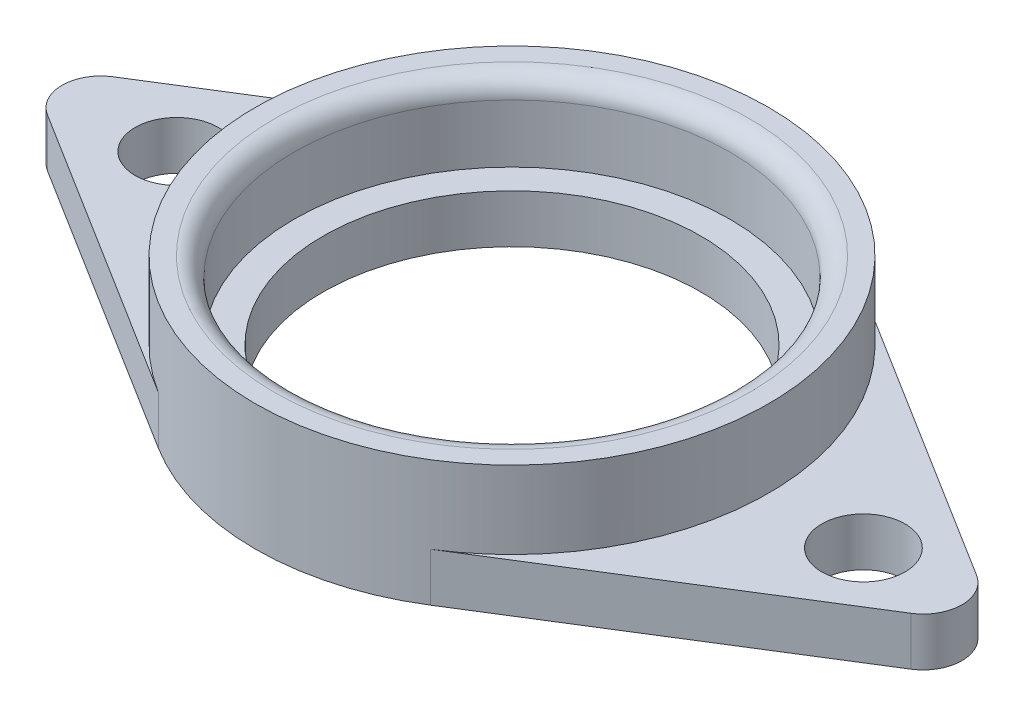
ISO-10303-21;
HEADER;
FILE_DESCRIPTION(('STEP AP214'),'2;1');
FILE_NAME('part.step','',(''),(''),'','','');
FILE_SCHEMA(('AUTOMOTIVE_DESIGN { 1 0 10303 214 1 1 1 1 }'));
ENDSEC;
DATA;
#1=APPLICATION_CONTEXT('core data for automotive mechanical design processes');
#2=APPLICATION_PROTOCOL_DEFINITION('international standard','automotive_design',2000,#1);
#3=PRODUCT_CONTEXT('',#1,'mechanical');
#4=PRODUCT('Part','Part','',(#3));
#5=PRODUCT_RELATED_PRODUCT_CATEGORY('part','',(#4));
#6=PRODUCT_DEFINITION_FORMATION('','',#4);
#7=PRODUCT_DEFINITION_CONTEXT('part definition',#1,'design');
#8=PRODUCT_DEFINITION('design','',#6,#7);
#9=PRODUCT_DEFINITION_SHAPE('','',#8);
#10=(LENGTH_UNIT() NAMED_UNIT(*) SI_UNIT(.MILLI.,.METRE.));
#11=(NAMED_UNIT(*) PLANE_ANGLE_UNIT() SI_UNIT($,.RADIAN.));
#12=(NAMED_UNIT(*) SI_UNIT($,.STERADIAN.) SOLID_ANGLE_UNIT());
#13=UNCERTAINTY_MEASURE_WITH_UNIT(LENGTH_MEASURE(1.E-05),#10,'distance_accuracy_value','');
#14=(GEOMETRIC_REPRESENTATION_CONTEXT(3) GLOBAL_UNCERTAINTY_ASSIGNED_CONTEXT((#13)) GLOBAL_UNIT_ASSIGNED_CONTEXT((#10,
#11,#12)) REPRESENTATION_CONTEXT('',''));
#15=CARTESIAN_POINT('',(0.,0.,0.));
#16=DIRECTION('',(0.,0.,1.));
#17=DIRECTION('',(1.,0.,0.));
#18=AXIS2_PLACEMENT_3D('',#15,#16,#17);
#19=CARTESIAN_POINT('',(0.,2.5,0.));
#20=DIRECTION('',(0.,1.,0.));
#21=DIRECTION('',(0.,0.,1.));
#22=AXIS2_PLACEMENT_3D('',#19,#20,#21);
#23=PLANE('',#22);
#24=CARTESIAN_POINT('',(0.,2.5,0.));
#25=DIRECTION('',(0.,1.,0.));
#26=DIRECTION('',(0.,0.,1.));
#27=AXIS2_PLACEMENT_3D('',#24,#25,#26);
#28=CIRCLE('',#27,13.25);
#29=CARTESIAN_POINT('',(7.02250000000001,2.5,11.2359687499565));
#30=VERTEX_POINT('',#29);
#31=CARTESIAN_POINT('',(7.0225,2.5,-11.2359687499565));
#32=VERTEX_POINT('',#31);
#33=EDGE_CURVE('E186',#30,#32,#28,.T.);
#34=ORIENTED_EDGE('',*,*,#33,.F.);
#35=DIRECTION('',(-0.847997641506154,0.,0.53));
#36=VECTOR('',#35,1.);
#37=CARTESIAN_POINT('',(7.0225,2.5,11.2359687499565));
#38=LINE('',#37,#36);
#39=CARTESIAN_POINT('',(22.2864150943396,2.5,1.6959952830123));
#40=VERTEX_POINT('',#39);
#41=EDGE_CURVE('E271',#40,#30,#38,.T.);
#42=ORIENTED_EDGE('',*,*,#41,.F.);
#43=CARTESIAN_POINT('',(21.2264150943396,2.5,0.));
#44=DIRECTION('',(0.,1.,0.));
#45=DIRECTION('',(0.,0.,1.));
#46=AXIS2_PLACEMENT_3D('',#43,#44,#45);
#47=CIRCLE('',#46,2.);
#48=CARTESIAN_POINT('',(22.2864150943396,2.5,-1.69599528301232));
#49=VERTEX_POINT('',#48);
#50=EDGE_CURVE('E133',#49,#40,#47,.F.);
#51=ORIENTED_EDGE('',*,*,#50,.F.);
#52=DIRECTION('',(0.847997641506154,0.,0.53));
#53=VECTOR('',#52,1.);
#54=CARTESIAN_POINT('',(7.0225,2.5,-11.2359687499565));
#55=LINE('',#54,#53);
#56=EDGE_CURVE('E130',#32,#49,#55,.T.);
#57=ORIENTED_EDGE('',*,*,#56,.F.);
#58=EDGE_LOOP('',(#34,#42,#51,#57));
#59=FACE_BOUND('',#58,.T.);
#60=CARTESIAN_POINT('',(18.1402262835206,2.5,0.));
#61=DIRECTION('',(0.,1.,0.));
#62=DIRECTION('',(0.,0.,1.));
#63=AXIS2_PLACEMENT_3D('',#60,#61,#62);
#64=CIRCLE('',#63,2.15);
#65=CARTESIAN_POINT('',(18.1402262835206,2.5,2.15));
#66=VERTEX_POINT('',#65);
#67=EDGE_CURVE('E172',#66,#66,#64,.T.);
#68=ORIENTED_EDGE('',*,*,#67,.F.);
#69=EDGE_LOOP('',(#68));
#70=FACE_BOUND('',#69,.T.);
#71=ADVANCED_FACE('F35',(#59,#70),#23,.T.);
#72=CARTESIAN_POINT('',(0.,2.5,0.));
#73=DIRECTION('',(0.,1.,0.));
#74=DIRECTION('',(0.,0.,1.));
#75=AXIS2_PLACEMENT_3D('',#72,#73,#74);
#76=CIRCLE('',#75,9.74999999999999);
#77=CARTESIAN_POINT('',(0.,2.5,9.74999999999999));
#78=VERTEX_POINT('',#77);
#79=EDGE_CURVE('E138',#78,#78,#76,.T.);
#80=ORIENTED_EDGE('',*,*,#79,.F.);
#81=EDGE_LOOP('',(#80));
#82=FACE_BOUND('',#81,.T.);
#83=CARTESIAN_POINT('',(0.,2.5,0.));
#84=DIRECTION('',(0.,1.,0.));
#85=DIRECTION('',(0.,0.,1.));
#86=AXIS2_PLACEMENT_3D('',#83,#84,#85);
#87=CIRCLE('',#86,11.25);
#88=CARTESIAN_POINT('',(0.,2.5,11.25));
#89=VERTEX_POINT('',#88);
#90=EDGE_CURVE('E191',#89,#89,#87,.T.);
#91=ORIENTED_EDGE('',*,*,#90,.T.);
#92=EDGE_LOOP('',(#91));
#93=FACE_BOUND('',#92,.T.);
#94=ADVANCED_FACE('F198',(#82,#93),#23,.T.);
#95=CARTESIAN_POINT('',(7.0225,2.5,11.2359687499565));
#96=DIRECTION('',(0.53,0.,0.847997641506154));
#97=DIRECTION('',(0.847997641506154,0.,-0.53));
#98=AXIS2_PLACEMENT_3D('',#95,#96,#97);
#99=PLANE('',#98);
#100=DIRECTION('',(-0.847997641506154,0.,0.53));
#101=VECTOR('',#100,1.);
#102=CARTESIAN_POINT('',(7.0225,0.,11.2359687499565));
#103=LINE('',#102,#101);
#104=CARTESIAN_POINT('',(22.2864150943396,0.,1.6959952830123));
#105=VERTEX_POINT('',#104);
#106=CARTESIAN_POINT('',(7.0225,0.,11.2359687499565));
#107=VERTEX_POINT('',#106);
#108=EDGE_CURVE('E147',#105,#107,#103,.T.);
#109=ORIENTED_EDGE('',*,*,#108,.F.);
#110=DIRECTION('',(0.,-1.,0.));
#111=VECTOR('',#110,1.);
#112=CARTESIAN_POINT('',(22.2864150943396,2.5,1.6959952830123));
#113=LINE('',#112,#111);
#114=EDGE_CURVE('E93',#40,#105,#113,.T.);
#115=ORIENTED_EDGE('',*,*,#114,.F.);
#116=ORIENTED_EDGE('',*,*,#41,.T.);
#117=DIRECTION('',(0.,-1.,0.));
#118=VECTOR('',#117,1.);
#119=CARTESIAN_POINT('',(7.0225,2.5,11.2359687499565));
#120=LINE('',#119,#118);
#121=EDGE_CURVE('E89',#30,#107,#120,.T.);
#122=ORIENTED_EDGE('',*,*,#121,.T.);
#123=EDGE_LOOP('',(#109,#115,#116,#122));
#124=FACE_BOUND('',#123,.T.);
#125=ADVANCED_FACE('F218',(#124),#99,.T.);
#126=CARTESIAN_POINT('',(21.2264150943396,2.5,0.));
#127=DIRECTION('',(0.,-1.,0.));
#128=DIRECTION('',(0.,0.,-1.));
#129=AXIS2_PLACEMENT_3D('',#126,#127,#128);
#130=CYLINDRICAL_SURFACE('',#129,2.);
#131=CARTESIAN_POINT('',(21.2264150943396,0.,0.));
#132=DIRECTION('',(0.,1.,0.));
#133=DIRECTION('',(0.,0.,1.));
#134=AXIS2_PLACEMENT_3D('',#131,#132,#133);
#135=CIRCLE('',#134,2.);
#136=CARTESIAN_POINT('',(22.2864150943396,0.,-1.69599528301232));
#137=VERTEX_POINT('',#136);
#138=EDGE_CURVE('E150',#137,#105,#135,.F.);
#139=ORIENTED_EDGE('',*,*,#138,.F.);
#140=DIRECTION('',(0.,-1.,0.));
#141=VECTOR('',#140,1.);
#142=CARTESIAN_POINT('',(22.2864150943396,2.5,-1.69599528301232));
#143=LINE('',#142,#141);
#144=EDGE_CURVE('E180',#49,#137,#143,.T.);
#145=ORIENTED_EDGE('',*,*,#144,.F.);
#146=ORIENTED_EDGE('',*,*,#50,.T.);
#147=ORIENTED_EDGE('',*,*,#114,.T.);
#148=EDGE_LOOP('',(#139,#145,#146,#147));
#149=FACE_BOUND('',#148,.T.);
#150=ADVANCED_FACE('F256',(#149),#130,.T.);
#151=CARTESIAN_POINT('',(7.0225,2.5,-11.2359687499565));
#152=DIRECTION('',(0.53,0.,-0.847997641506154));
#153=DIRECTION('',(-0.847997641506154,0.,-0.53));
#154=AXIS2_PLACEMENT_3D('',#151,#152,#153);
#155=PLANE('',#154);
#156=DIRECTION('',(0.847997641506154,0.,0.53));
#157=VECTOR('',#156,1.);
#158=CARTESIAN_POINT('',(7.0225,0.,-11.2359687499565));
#159=LINE('',#158,#157);
#160=CARTESIAN_POINT('',(7.0225,0.,-11.2359687499565));
#161=VERTEX_POINT('',#160);
#162=EDGE_CURVE('E153',#161,#137,#159,.T.);
#163=ORIENTED_EDGE('',*,*,#162,.F.);
#164=DIRECTION('',(0.,-1.,0.));
#165=VECTOR('',#164,1.);
#166=CARTESIAN_POINT('',(7.0225,2.5,-11.2359687499565));
#167=LINE('',#166,#165);
#168=EDGE_CURVE('E178',#32,#161,#167,.T.);
#169=ORIENTED_EDGE('',*,*,#168,.F.);
#170=ORIENTED_EDGE('',*,*,#56,.T.);
#171=ORIENTED_EDGE('',*,*,#144,.T.);
#172=EDGE_LOOP('',(#163,#169,#170,#171));
#173=FACE_BOUND('',#172,.T.);
#174=ADVANCED_FACE('F253',(#173),#155,.T.);
#175=CARTESIAN_POINT('',(-7.02250000000001,2.5,-11.2359687499565));
#176=DIRECTION('',(-0.53,0.,-0.847997641506154));
#177=DIRECTION('',(-0.847997641506154,0.,0.53));
#178=AXIS2_PLACEMENT_3D('',#175,#176,#177);
#179=PLANE('',#178);
#180=DIRECTION('',(0.847997641506154,0.,-0.53));
#181=VECTOR('',#180,1.);
#182=CARTESIAN_POINT('',(-7.02250000000001,0.,-11.2359687499565));
#183=LINE('',#182,#181);
#184=CARTESIAN_POINT('',(-22.2864150943396,0.,-1.69599528301231));
#185=VERTEX_POINT('',#184);
#186=CARTESIAN_POINT('',(-7.0225,0.,-11.2359687499565));
#187=VERTEX_POINT('',#186);
#188=EDGE_CURVE('E113',#185,#187,#183,.T.);
#189=ORIENTED_EDGE('',*,*,#188,.F.);
#190=DIRECTION('',(0.,-1.,0.));
#191=VECTOR('',#190,1.);
#192=CARTESIAN_POINT('',(-22.2864150943396,2.5,-1.69599528301231));
#193=LINE('',#192,#191);
#194=CARTESIAN_POINT('',(-22.2864150943396,2.5,-1.69599528301231));
#195=VERTEX_POINT('',#194);
#196=EDGE_CURVE('E107',#195,#185,#193,.T.);
#197=ORIENTED_EDGE('',*,*,#196,.F.);
#198=DIRECTION('',(0.847997641506154,0.,-0.53));
#199=VECTOR('',#198,1.);
#200=CARTESIAN_POINT('',(-7.02250000000001,2.5,-11.2359687499565));
#201=LINE('',#200,#199);
#202=CARTESIAN_POINT('',(-7.0225,2.5,-11.2359687499565));
#203=VERTEX_POINT('',#202);
#204=EDGE_CURVE('E111',#195,#203,#201,.T.);
#205=ORIENTED_EDGE('',*,*,#204,.T.);
#206=DIRECTION('',(0.,-1.,0.));
#207=VECTOR('',#206,1.);
#208=CARTESIAN_POINT('',(-7.0225,2.5,-11.2359687499565));
#209=LINE('',#208,#207);
#210=EDGE_CURVE('E117',#203,#187,#209,.T.);
#211=ORIENTED_EDGE('',*,*,#210,.T.);
#212=EDGE_LOOP('',(#189,#197,#205,#211));
#213=FACE_BOUND('',#212,.T.);
#214=ADVANCED_FACE('F109',(#213),#179,.T.);
#215=CARTESIAN_POINT('',(-21.2264150943396,2.5,0.));
#216=DIRECTION('',(0.,-1.,0.));
#217=DIRECTION('',(0.,0.,-1.));
#218=AXIS2_PLACEMENT_3D('',#215,#216,#217);
#219=CYLINDRICAL_SURFACE('',#218,2.);
#220=CARTESIAN_POINT('',(-21.2264150943396,0.,0.));
#221=DIRECTION('',(0.,1.,0.));
#222=DIRECTION('',(0.,0.,1.));
#223=AXIS2_PLACEMENT_3D('',#220,#221,#222);
#224=CIRCLE('',#223,2.);
#225=CARTESIAN_POINT('',(-22.2864150943396,0.,1.69599528301231));
#226=VERTEX_POINT('',#225);
#227=EDGE_CURVE('E160',#185,#226,#224,.T.);
#228=ORIENTED_EDGE('',*,*,#227,.T.);
#229=DIRECTION('',(0.,-1.,0.));
#230=VECTOR('',#229,1.);
#231=CARTESIAN_POINT('',(-22.2864150943396,2.5,1.69599528301231));
#232=LINE('',#231,#230);
#233=CARTESIAN_POINT('',(-22.2864150943396,2.5,1.69599528301231));
#234=VERTEX_POINT('',#233);
#235=EDGE_CURVE('E118',#234,#226,#232,.T.);
#236=ORIENTED_EDGE('',*,*,#235,.F.);
#237=CARTESIAN_POINT('',(-21.2264150943396,2.5,0.));
#238=DIRECTION('',(0.,1.,0.));
#239=DIRECTION('',(0.,0.,1.));
#240=AXIS2_PLACEMENT_3D('',#237,#238,#239);
#241=CIRCLE('',#240,2.);
#242=EDGE_CURVE('E121',#195,#234,#241,.T.);
#243=ORIENTED_EDGE('',*,*,#242,.F.);
#244=ORIENTED_EDGE('',*,*,#196,.T.);
#245=EDGE_LOOP('',(#228,#236,#243,#244));
#246=FACE_BOUND('',#245,.T.);
#247=ADVANCED_FACE('F122',(#246),#219,.T.);
#248=CARTESIAN_POINT('',(-7.0225,2.5,11.2359687499565));
#249=DIRECTION('',(0.53,0.,-0.847997641506154));
#250=DIRECTION('',(-0.847997641506154,0.,-0.53));
#251=AXIS2_PLACEMENT_3D('',#248,#249,#250);
#252=PLANE('',#251);
#253=DIRECTION('',(0.847997641506154,0.,0.53));
#254=VECTOR('',#253,1.);
#255=CARTESIAN_POINT('',(-7.0225,0.,11.2359687499565));
#256=LINE('',#255,#254);
#257=CARTESIAN_POINT('',(-7.0225,0.,11.2359687499565));
#258=VERTEX_POINT('',#257);
#259=EDGE_CURVE('E162',#226,#258,#256,.T.);
#260=ORIENTED_EDGE('',*,*,#259,.T.);
#261=DIRECTION('',(0.,-1.,0.));
#262=VECTOR('',#261,1.);
#263=CARTESIAN_POINT('',(-7.0225,2.5,11.2359687499565));
#264=LINE('',#263,#262);
#265=CARTESIAN_POINT('',(-7.0225,2.5,11.2359687499565));
#266=VERTEX_POINT('',#265);
#267=EDGE_CURVE('E174',#266,#258,#264,.T.);
#268=ORIENTED_EDGE('',*,*,#267,.F.);
#269=DIRECTION('',(0.847997641506154,0.,0.53));
#270=VECTOR('',#269,1.);
#271=CARTESIAN_POINT('',(-7.0225,2.5,11.2359687499565));
#272=LINE('',#271,#270);
#273=EDGE_CURVE('E52',#234,#266,#272,.T.);
#274=ORIENTED_EDGE('',*,*,#273,.F.);
#275=ORIENTED_EDGE('',*,*,#235,.T.);
#276=EDGE_LOOP('',(#260,#268,#274,#275));
#277=FACE_BOUND('',#276,.T.);
#278=ADVANCED_FACE('F242',(#277),#252,.F.);
#279=CARTESIAN_POINT('',(0.,2.5,0.));
#280=DIRECTION('',(0.,-1.,0.));
#281=DIRECTION('',(0.,0.,-1.));
#282=AXIS2_PLACEMENT_3D('',#279,#280,#281);
#283=CYLINDRICAL_SURFACE('',#282,9.74999999999999);
#284=ORIENTED_EDGE('',*,*,#79,.T.);
#285=EDGE_LOOP('',(#284));
#286=FACE_BOUND('',#285,.T.);
#287=CARTESIAN_POINT('',(0.,0.,0.));
#288=DIRECTION('',(0.,1.,0.));
#289=DIRECTION('',(0.,0.,1.));
#290=AXIS2_PLACEMENT_3D('',#287,#288,#289);
#291=CIRCLE('',#290,9.74999999999999);
#292=CARTESIAN_POINT('',(0.,0.,9.74999999999999));
#293=VERTEX_POINT('',#292);
#294=EDGE_CURVE('E166',#293,#293,#291,.T.);
#295=ORIENTED_EDGE('',*,*,#294,.F.);
#296=EDGE_LOOP('',(#295));
#297=FACE_BOUND('',#296,.T.);
#298=ADVANCED_FACE('F239',(#286,#297),#283,.F.);
#299=CARTESIAN_POINT('',(0.,2.5,0.));
#300=DIRECTION('',(0.,-1.,0.));
#301=DIRECTION('',(0.,0.,-1.));
#302=AXIS2_PLACEMENT_3D('',#299,#300,#301);
#303=CYLINDRICAL_SURFACE('',#302,13.25);
#304=CARTESIAN_POINT('',(0.,0.,0.));
#305=DIRECTION('',(0.,1.,0.));
#306=DIRECTION('',(0.,0.,1.));
#307=AXIS2_PLACEMENT_3D('',#304,#305,#306);
#308=CIRCLE('',#307,13.25);
#309=EDGE_CURVE('E81',#258,#107,#308,.T.);
#310=ORIENTED_EDGE('',*,*,#309,.T.);
#311=ORIENTED_EDGE('',*,*,#121,.F.);
#312=ORIENTED_EDGE('',*,*,#33,.T.);
#313=ORIENTED_EDGE('',*,*,#168,.T.);
#314=CARTESIAN_POINT('',(0.,0.,0.));
#315=DIRECTION('',(0.,1.,0.));
#316=DIRECTION('',(0.,0.,1.));
#317=AXIS2_PLACEMENT_3D('',#314,#315,#316);
#318=CIRCLE('',#317,13.25);
#319=EDGE_CURVE('E156',#161,#187,#318,.T.);
#320=ORIENTED_EDGE('',*,*,#319,.T.);
#321=ORIENTED_EDGE('',*,*,#210,.F.);
#322=EDGE_CURVE('E128',#203,#266,#28,.T.);
#323=ORIENTED_EDGE('',*,*,#322,.T.);
#324=ORIENTED_EDGE('',*,*,#267,.T.);
#325=EDGE_LOOP('',(#310,#311,#312,#313,#320,#321,#323,#324));
#326=FACE_BOUND('',#325,.T.);
#327=CARTESIAN_POINT('',(0.,6.5,0.));
#328=DIRECTION('',(0.,1.,0.));
#329=DIRECTION('',(0.,0.,1.));
#330=AXIS2_PLACEMENT_3D('',#327,#328,#329);
#331=CIRCLE('',#330,13.25);
#332=CARTESIAN_POINT('',(0.,6.5,13.25));
#333=VERTEX_POINT('',#332);
#334=EDGE_CURVE('E148',#333,#333,#331,.T.);
#335=ORIENTED_EDGE('',*,*,#334,.F.);
#336=EDGE_LOOP('',(#335));
#337=FACE_BOUND('',#336,.T.);
#338=ADVANCED_FACE('F235',(#326,#337),#303,.T.);
#339=CARTESIAN_POINT('',(18.1402262835206,2.5,0.));
#340=DIRECTION('',(0.,-1.,0.));
#341=DIRECTION('',(0.,0.,-1.));
#342=AXIS2_PLACEMENT_3D('',#339,#340,#341);
#343=CYLINDRICAL_SURFACE('',#342,2.15);
#344=ORIENTED_EDGE('',*,*,#67,.T.);
#345=EDGE_LOOP('',(#344));
#346=FACE_BOUND('',#345,.T.);
#347=CARTESIAN_POINT('',(18.1402262835206,0.,0.));
#348=DIRECTION('',(0.,1.,0.));
#349=DIRECTION('',(0.,0.,1.));
#350=AXIS2_PLACEMENT_3D('',#347,#348,#349);
#351=CIRCLE('',#350,2.15);
#352=CARTESIAN_POINT('',(18.1402262835206,0.,2.15));
#353=VERTEX_POINT('',#352);
#354=EDGE_CURVE('E144',#353,#353,#351,.T.);
#355=ORIENTED_EDGE('',*,*,#354,.F.);
#356=EDGE_LOOP('',(#355));
#357=FACE_BOUND('',#356,.T.);
#358=ADVANCED_FACE('F229',(#346,#357),#343,.F.);
#359=CARTESIAN_POINT('',(-17.3051980294616,2.5,0.));
#360=DIRECTION('',(0.,-1.,0.));
#361=DIRECTION('',(0.,0.,-1.));
#362=AXIS2_PLACEMENT_3D('',#359,#360,#361);
#363=CYLINDRICAL_SURFACE('',#362,2.15);
#364=CARTESIAN_POINT('',(-17.3051980294616,2.5,0.));
#365=DIRECTION('',(0.,1.,0.));
#366=DIRECTION('',(0.,0.,1.));
#367=AXIS2_PLACEMENT_3D('',#364,#365,#366);
#368=CIRCLE('',#367,2.15);
#369=CARTESIAN_POINT('',(-17.3051980294616,2.5,2.15));
#370=VERTEX_POINT('',#369);
#371=EDGE_CURVE('E141',#370,#370,#368,.T.);
#372=ORIENTED_EDGE('',*,*,#371,.T.);
#373=EDGE_LOOP('',(#372));
#374=FACE_BOUND('',#373,.T.);
#375=CARTESIAN_POINT('',(-17.3051980294616,0.,0.));
#376=DIRECTION('',(0.,1.,0.));
#377=DIRECTION('',(0.,0.,1.));
#378=AXIS2_PLACEMENT_3D('',#375,#376,#377);
#379=CIRCLE('',#378,2.15);
#380=CARTESIAN_POINT('',(-17.3051980294616,0.,2.15));
#381=VERTEX_POINT('',#380);
#382=EDGE_CURVE('E169',#381,#381,#379,.T.);
#383=ORIENTED_EDGE('',*,*,#382,.F.);
#384=EDGE_LOOP('',(#383));
#385=FACE_BOUND('',#384,.T.);
#386=ADVANCED_FACE('F223',(#374,#385),#363,.F.);
#387=ORIENTED_EDGE('',*,*,#322,.F.);
#388=ORIENTED_EDGE('',*,*,#204,.F.);
#389=ORIENTED_EDGE('',*,*,#242,.T.);
#390=ORIENTED_EDGE('',*,*,#273,.T.);
#391=EDGE_LOOP('',(#387,#388,#389,#390));
#392=FACE_BOUND('',#391,.T.);
#393=ORIENTED_EDGE('',*,*,#371,.F.);
#394=EDGE_LOOP('',(#393));
#395=FACE_BOUND('',#394,.T.);
#396=ADVANCED_FACE('F125',(#392,#395),#23,.T.);
#397=CARTESIAN_POINT('',(0.,0.,0.));
#398=DIRECTION('',(0.,1.,0.));
#399=DIRECTION('',(0.,0.,1.));
#400=AXIS2_PLACEMENT_3D('',#397,#398,#399);
#401=PLANE('',#400);
#402=ORIENTED_EDGE('',*,*,#354,.T.);
#403=EDGE_LOOP('',(#402));
#404=FACE_BOUND('',#403,.T.);
#405=ORIENTED_EDGE('',*,*,#108,.T.);
#406=ORIENTED_EDGE('',*,*,#309,.F.);
#407=ORIENTED_EDGE('',*,*,#259,.F.);
#408=ORIENTED_EDGE('',*,*,#227,.F.);
#409=ORIENTED_EDGE('',*,*,#188,.T.);
#410=ORIENTED_EDGE('',*,*,#319,.F.);
#411=ORIENTED_EDGE('',*,*,#162,.T.);
#412=ORIENTED_EDGE('',*,*,#138,.T.);
#413=EDGE_LOOP('',(#405,#406,#407,#408,#409,#410,#411,#412));
#414=FACE_BOUND('',#413,.T.);
#415=ORIENTED_EDGE('',*,*,#294,.T.);
#416=EDGE_LOOP('',(#415));
#417=FACE_BOUND('',#416,.T.);
#418=ORIENTED_EDGE('',*,*,#382,.T.);
#419=EDGE_LOOP('',(#418));
#420=FACE_BOUND('',#419,.T.);
#421=ADVANCED_FACE('F209',(#404,#414,#417,#420),#401,.F.);
#422=CARTESIAN_POINT('',(0.,6.5,0.));
#423=DIRECTION('',(0.,1.,0.));
#424=DIRECTION('',(0.,0.,1.));
#425=AXIS2_PLACEMENT_3D('',#422,#423,#424);
#426=PLANE('',#425);
#427=CARTESIAN_POINT('',(0.,6.5,0.));
#428=DIRECTION('',(0.,1.,0.));
#429=DIRECTION('',(0.,0.,1.));
#430=AXIS2_PLACEMENT_3D('',#427,#428,#429);
#431=CIRCLE('',#430,12.25);
#432=CARTESIAN_POINT('',(0.,6.5,12.25));
#433=VERTEX_POINT('',#432);
#434=EDGE_CURVE('E11',#433,#433,#431,.F.);
#435=ORIENTED_EDGE('',*,*,#434,.T.);
#436=EDGE_LOOP('',(#435));
#437=FACE_BOUND('',#436,.T.);
#438=ORIENTED_EDGE('',*,*,#334,.T.);
#439=EDGE_LOOP('',(#438));
#440=FACE_BOUND('',#439,.T.);
#441=ADVANCED_FACE('F202',(#437,#440),#426,.T.);
#442=CARTESIAN_POINT('',(0.,6.5,0.));
#443=DIRECTION('',(0.,-1.,0.));
#444=DIRECTION('',(0.,0.,-1.));
#445=AXIS2_PLACEMENT_3D('',#442,#443,#444);
#446=CYLINDRICAL_SURFACE('',#445,11.25);
#447=CARTESIAN_POINT('',(0.,5.5,0.));
#448=DIRECTION('',(0.,1.,0.));
#449=DIRECTION('',(0.,0.,1.));
#450=AXIS2_PLACEMENT_3D('',#447,#448,#449);
#451=CIRCLE('',#450,11.25);
#452=CARTESIAN_POINT('',(0.,5.5,11.25));
#453=VERTEX_POINT('',#452);
#454=EDGE_CURVE('E44',#453,#453,#451,.T.);
#455=ORIENTED_EDGE('',*,*,#454,.T.);
#456=EDGE_LOOP('',(#455));
#457=FACE_BOUND('',#456,.T.);
#458=ORIENTED_EDGE('',*,*,#90,.F.);
#459=EDGE_LOOP('',(#458));
#460=FACE_BOUND('',#459,.T.);
#461=ADVANCED_FACE('F200',(#457,#460),#446,.F.);
#462=CARTESIAN_POINT('',(0.,5.5,0.));
#463=DIRECTION('',(0.,1.,0.));
#464=DIRECTION('',(0.,0.,1.));
#465=AXIS2_PLACEMENT_3D('',#462,#463,#464);
#466=TOROIDAL_SURFACE('',#465,12.25,1.);
#467=ORIENTED_EDGE('',*,*,#434,.F.);
#468=EDGE_LOOP('',(#467));
#469=FACE_BOUND('',#468,.T.);
#470=ORIENTED_EDGE('',*,*,#454,.F.);
#471=EDGE_LOOP('',(#470));
#472=FACE_BOUND('',#471,.T.);
#473=ADVANCED_FACE('F37',(#469,#472),#466,.T.);
#474=CLOSED_SHELL('',(#71,#94,#125,#150,#174,#214,#247,#278,#298,#338,#358,#386,#396,#421,#441,
#461,#473));
#475=MANIFOLD_SOLID_BREP('B2',#474);
#476=ADVANCED_BREP_SHAPE_REPRESENTATION('',(#18,#475),#14);
#477=SHAPE_DEFINITION_REPRESENTATION(#9,#476);
ENDSEC;
END-ISO-10303-21;
